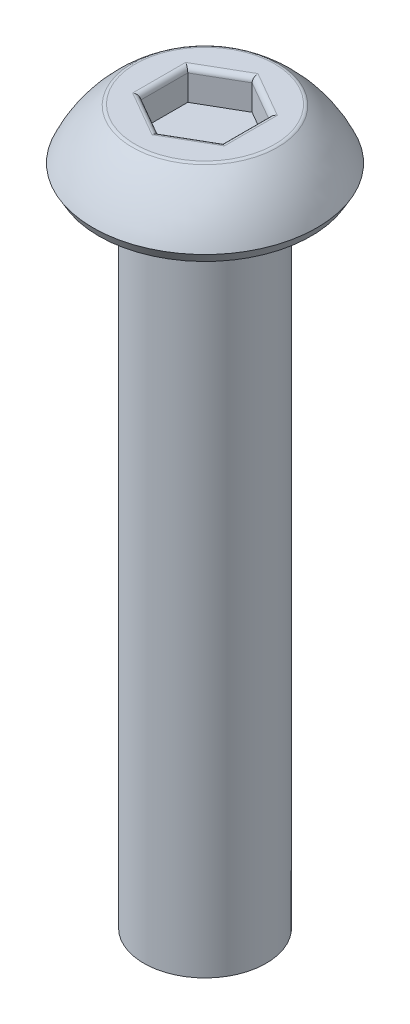
ISO-10303-21;
HEADER;
FILE_DESCRIPTION(('STEP AP214'),'2;1');
FILE_NAME('part.step','',(''),(''),'','','');
FILE_SCHEMA(('AUTOMOTIVE_DESIGN { 1 0 10303 214 1 1 1 1 }'));
ENDSEC;
DATA;
#1=APPLICATION_CONTEXT('core data for automotive mechanical design processes');
#2=APPLICATION_PROTOCOL_DEFINITION('international standard','automotive_design',2000,#1);
#3=PRODUCT_CONTEXT('',#1,'mechanical');
#4=PRODUCT('Part','Part','',(#3));
#5=PRODUCT_RELATED_PRODUCT_CATEGORY('part','',(#4));
#6=PRODUCT_DEFINITION_FORMATION('','',#4);
#7=PRODUCT_DEFINITION_CONTEXT('part definition',#1,'design');
#8=PRODUCT_DEFINITION('design','',#6,#7);
#9=PRODUCT_DEFINITION_SHAPE('','',#8);
#10=(LENGTH_UNIT() NAMED_UNIT(*) SI_UNIT(.MILLI.,.METRE.));
#11=(NAMED_UNIT(*) PLANE_ANGLE_UNIT() SI_UNIT($,.RADIAN.));
#12=(NAMED_UNIT(*) SI_UNIT($,.STERADIAN.) SOLID_ANGLE_UNIT());
#13=UNCERTAINTY_MEASURE_WITH_UNIT(LENGTH_MEASURE(1.E-05),#10,'distance_accuracy_value','');
#14=(GEOMETRIC_REPRESENTATION_CONTEXT(3) GLOBAL_UNCERTAINTY_ASSIGNED_CONTEXT((#13)) GLOBAL_UNIT_ASSIGNED_CONTEXT((#10,
#11,#12)) REPRESENTATION_CONTEXT('',''));
#15=CARTESIAN_POINT('',(0.,0.,0.));
#16=DIRECTION('',(0.,0.,1.));
#17=DIRECTION('',(1.,0.,0.));
#18=AXIS2_PLACEMENT_3D('',#15,#16,#17);
#19=CARTESIAN_POINT('',(0.,1.5,0.));
#20=DIRECTION('',(0.,-1.,0.));
#21=DIRECTION('',(0.,0.,-1.));
#22=AXIS2_PLACEMENT_3D('',#19,#20,#21);
#23=PLANE('',#22);
#24=CARTESIAN_POINT('',(0.,1.5,0.));
#25=DIRECTION('',(0.,-1.,0.));
#26=DIRECTION('',(0.,0.,-1.));
#27=AXIS2_PLACEMENT_3D('',#24,#25,#26);
#28=CIRCLE('',#27,1.70906948191647);
#29=CARTESIAN_POINT('',(0.,1.5,-1.70906948191647));
#30=VERTEX_POINT('',#29);
#31=EDGE_CURVE('E178',#30,#30,#28,.F.);
#32=ORIENTED_EDGE('',*,*,#31,.T.);
#33=EDGE_LOOP('',(#32));
#34=FACE_BOUND('',#33,.T.);
#35=DIRECTION('',(0.866025403784439,0.,-0.5));
#36=VECTOR('',#35,1.);
#37=CARTESIAN_POINT('',(0.5625,1.5,0.974278579257493));
#38=LINE('',#37,#36);
#39=CARTESIAN_POINT('',(1.125,1.5,0.649519052838329));
#40=VERTEX_POINT('',#39);
#41=CARTESIAN_POINT('',(0.,1.5,1.29903810567666));
#42=VERTEX_POINT('',#41);
#43=EDGE_CURVE('E173',#40,#42,#38,.F.);
#44=ORIENTED_EDGE('',*,*,#43,.T.);
#45=DIRECTION('',(0.866025403784439,0.,0.5));
#46=VECTOR('',#45,1.);
#47=CARTESIAN_POINT('',(-0.5625,1.5,0.974278579257493));
#48=LINE('',#47,#46);
#49=CARTESIAN_POINT('',(-1.125,1.5,0.649519052838329));
#50=VERTEX_POINT('',#49);
#51=EDGE_CURVE('E175',#42,#50,#48,.F.);
#52=ORIENTED_EDGE('',*,*,#51,.T.);
#53=DIRECTION('',(0.,0.,1.));
#54=VECTOR('',#53,1.);
#55=CARTESIAN_POINT('',(-1.125,1.5,0.));
#56=LINE('',#55,#54);
#57=CARTESIAN_POINT('',(-1.125,1.5,-0.649519052838329));
#58=VERTEX_POINT('',#57);
#59=EDGE_CURVE('E165',#50,#58,#56,.F.);
#60=ORIENTED_EDGE('',*,*,#59,.T.);
#61=DIRECTION('',(-0.866025403784439,0.,0.5));
#62=VECTOR('',#61,1.);
#63=CARTESIAN_POINT('',(-0.5625,1.5,-0.974278579257493));
#64=LINE('',#63,#62);
#65=CARTESIAN_POINT('',(0.,1.5,-1.29903810567666));
#66=VERTEX_POINT('',#65);
#67=EDGE_CURVE('E167',#58,#66,#64,.F.);
#68=ORIENTED_EDGE('',*,*,#67,.T.);
#69=DIRECTION('',(-0.866025403784439,0.,-0.5));
#70=VECTOR('',#69,1.);
#71=CARTESIAN_POINT('',(0.5625,1.5,-0.974278579257494));
#72=LINE('',#71,#70);
#73=CARTESIAN_POINT('',(1.125,1.5,-0.64951905283833));
#74=VERTEX_POINT('',#73);
#75=EDGE_CURVE('E169',#66,#74,#72,.F.);
#76=ORIENTED_EDGE('',*,*,#75,.T.);
#77=DIRECTION('',(0.,0.,-1.));
#78=VECTOR('',#77,1.);
#79=CARTESIAN_POINT('',(1.125,1.5,0.));
#80=LINE('',#79,#78);
#81=EDGE_CURVE('E171',#74,#40,#80,.F.);
#82=ORIENTED_EDGE('',*,*,#81,.T.);
#83=EDGE_LOOP('',(#44,#52,#60,#68,#76,#82));
#84=FACE_BOUND('',#83,.T.);
#85=ADVANCED_FACE('F36',(#34,#84),#23,.F.);
#86=CARTESIAN_POINT('',(0.,-0.931154789034212,0.));
#87=DIRECTION('',(0.,-1.,0.));
#88=DIRECTION('',(0.,0.,-1.));
#89=AXIS2_PLACEMENT_3D('',#86,#87,#88);
#90=DEGENERATE_TOROIDAL_SURFACE('',#89,0.00769348629276519,3.,.F.);
#91=CARTESIAN_POINT('',(0.,1.47526759952323,0.));
#92=DIRECTION('',(0.,-1.,0.));
#93=DIRECTION('',(0.,0.,-1.));
#94=AXIS2_PLACEMENT_3D('',#91,#92,#93);
#95=CIRCLE('',#94,1.78371135009948);
#96=CARTESIAN_POINT('',(0.,1.47526759952323,-1.78371135009948));
#97=VERTEX_POINT('',#96);
#98=EDGE_CURVE('E162',#97,#97,#95,.T.);
#99=ORIENTED_EDGE('',*,*,#98,.T.);
#100=EDGE_LOOP('',(#99));
#101=FACE_BOUND('',#100,.T.);
#102=CARTESIAN_POINT('',(0.,0.25,0.));
#103=DIRECTION('',(0.,-1.,0.));
#104=DIRECTION('',(0.,0.,-1.));
#105=AXIS2_PLACEMENT_3D('',#102,#103,#104);
#106=CIRCLE('',#105,2.75);
#107=CARTESIAN_POINT('',(0.,0.25,-2.75));
#108=VERTEX_POINT('',#107);
#109=EDGE_CURVE('E159',#108,#108,#106,.T.);
#110=ORIENTED_EDGE('',*,*,#109,.F.);
#111=EDGE_LOOP('',(#110));
#112=FACE_BOUND('',#111,.T.);
#113=ADVANCED_FACE('F245',(#101,#112),#90,.F.);
#114=CARTESIAN_POINT('',(0.,0.25,0.));
#115=DIRECTION('',(0.,1.,0.));
#116=DIRECTION('',(0.,0.,1.));
#117=AXIS2_PLACEMENT_3D('',#114,#115,#116);
#118=CONICAL_SURFACE('',#117,2.75,0.523598775598296);
#119=CARTESIAN_POINT('',(0.,0.,0.));
#120=DIRECTION('',(0.,-1.,0.));
#121=DIRECTION('',(0.,0.,-1.));
#122=AXIS2_PLACEMENT_3D('',#119,#120,#121);
#123=CIRCLE('',#122,2.60566243270259);
#124=CARTESIAN_POINT('',(0.,0.,-2.60566243270259));
#125=VERTEX_POINT('',#124);
#126=EDGE_CURVE('E156',#125,#125,#123,.T.);
#127=ORIENTED_EDGE('',*,*,#126,.F.);
#128=EDGE_LOOP('',(#127));
#129=FACE_BOUND('',#128,.T.);
#130=ORIENTED_EDGE('',*,*,#109,.T.);
#131=EDGE_LOOP('',(#130));
#132=FACE_BOUND('',#131,.T.);
#133=ADVANCED_FACE('F251',(#129,#132),#118,.T.);
#134=CARTESIAN_POINT('',(0.,0.,2.60566243270259));
#135=DIRECTION('',(0.,1.,0.));
#136=DIRECTION('',(0.,0.,1.));
#137=AXIS2_PLACEMENT_3D('',#134,#135,#136);
#138=PLANE('',#137);
#139=CARTESIAN_POINT('',(0.,0.,0.));
#140=DIRECTION('',(0.,-1.,0.));
#141=DIRECTION('',(0.,0.,-1.));
#142=AXIS2_PLACEMENT_3D('',#139,#140,#141);
#143=CIRCLE('',#142,1.5);
#144=CARTESIAN_POINT('',(0.,0.,-1.5));
#145=VERTEX_POINT('',#144);
#146=EDGE_CURVE('E153',#145,#145,#143,.T.);
#147=ORIENTED_EDGE('',*,*,#146,.F.);
#148=EDGE_LOOP('',(#147));
#149=FACE_BOUND('',#148,.T.);
#150=ORIENTED_EDGE('',*,*,#126,.T.);
#151=EDGE_LOOP('',(#150));
#152=FACE_BOUND('',#151,.T.);
#153=ADVANCED_FACE('F270',(#149,#152),#138,.F.);
#154=CARTESIAN_POINT('',(0.,-16.,0.));
#155=DIRECTION('',(0.,-1.,0.));
#156=DIRECTION('',(0.,0.,-1.));
#157=AXIS2_PLACEMENT_3D('',#154,#155,#156);
#158=CYLINDRICAL_SURFACE('',#157,1.5);
#159=CARTESIAN_POINT('',(0.,-16.,0.));
#160=DIRECTION('',(0.,-1.,0.));
#161=DIRECTION('',(0.,0.,-1.));
#162=AXIS2_PLACEMENT_3D('',#159,#160,#161);
#163=CIRCLE('',#162,1.5);
#164=CARTESIAN_POINT('',(0.,-16.,-1.5));
#165=VERTEX_POINT('',#164);
#166=EDGE_CURVE('E140',#165,#165,#163,.T.);
#167=ORIENTED_EDGE('',*,*,#166,.F.);
#168=EDGE_LOOP('',(#167));
#169=FACE_BOUND('',#168,.T.);
#170=ORIENTED_EDGE('',*,*,#146,.T.);
#171=EDGE_LOOP('',(#170));
#172=FACE_BOUND('',#171,.T.);
#173=ADVANCED_FACE('F275',(#169,#172),#158,.T.);
#174=CARTESIAN_POINT('',(0.,-16.,1.5));
#175=DIRECTION('',(0.,1.,0.));
#176=DIRECTION('',(0.,0.,1.));
#177=AXIS2_PLACEMENT_3D('',#174,#175,#176);
#178=PLANE('',#177);
#179=ORIENTED_EDGE('',*,*,#166,.T.);
#180=EDGE_LOOP('',(#179));
#181=FACE_BOUND('',#180,.T.);
#182=ADVANCED_FACE('F282',(#181),#178,.F.);
#183=CARTESIAN_POINT('',(0.999999999999999,0.75,-0.577350269189626));
#184=DIRECTION('',(0.5,0.,-0.866025403784439));
#185=DIRECTION('',(-0.866025403784439,0.,-0.5));
#186=AXIS2_PLACEMENT_3D('',#183,#184,#185);
#187=PLANE('',#186);
#188=DIRECTION('',(0.,1.,0.));
#189=VECTOR('',#188,1.);
#190=CARTESIAN_POINT('',(0.999999999999999,0.75,-0.577350269189626));
#191=LINE('',#190,#189);
#192=CARTESIAN_POINT('',(0.999999999999999,0.75,-0.577350269189626));
#193=VERTEX_POINT('',#192);
#194=CARTESIAN_POINT('',(0.999999999999999,1.375,-0.577350269189626));
#195=VERTEX_POINT('',#194);
#196=EDGE_CURVE('E138',#193,#195,#191,.T.);
#197=ORIENTED_EDGE('',*,*,#196,.T.);
#198=DIRECTION('',(-0.866025403784439,0.,-0.5));
#199=VECTOR('',#198,1.);
#200=CARTESIAN_POINT('',(0.999999999999999,1.375,-0.577350269189626));
#201=LINE('',#200,#199);
#202=CARTESIAN_POINT('',(0.,1.375,-1.15470053837925));
#203=VERTEX_POINT('',#202);
#204=EDGE_CURVE('E60',#195,#203,#201,.T.);
#205=ORIENTED_EDGE('',*,*,#204,.T.);
#206=DIRECTION('',(0.,1.,0.));
#207=VECTOR('',#206,1.);
#208=CARTESIAN_POINT('',(0.,0.75,-1.15470053837925));
#209=LINE('',#208,#207);
#210=CARTESIAN_POINT('',(0.,0.75,-1.15470053837925));
#211=VERTEX_POINT('',#210);
#212=EDGE_CURVE('E106',#211,#203,#209,.T.);
#213=ORIENTED_EDGE('',*,*,#212,.F.);
#214=DIRECTION('',(-0.866025403784439,0.,-0.5));
#215=VECTOR('',#214,1.);
#216=CARTESIAN_POINT('',(0.999999999999999,0.75,-0.577350269189626));
#217=LINE('',#216,#215);
#218=EDGE_CURVE('E110',#193,#211,#217,.T.);
#219=ORIENTED_EDGE('',*,*,#218,.F.);
#220=EDGE_LOOP('',(#197,#205,#213,#219));
#221=FACE_BOUND('',#220,.T.);
#222=ADVANCED_FACE('F108',(#221),#187,.F.);
#223=CARTESIAN_POINT('',(1.,0.75,0.577350269189626));
#224=DIRECTION('',(1.,0.,0.));
#225=DIRECTION('',(0.,0.,-1.));
#226=AXIS2_PLACEMENT_3D('',#223,#224,#225);
#227=PLANE('',#226);
#228=DIRECTION('',(0.,1.,0.));
#229=VECTOR('',#228,1.);
#230=CARTESIAN_POINT('',(1.,0.75,0.577350269189626));
#231=LINE('',#230,#229);
#232=CARTESIAN_POINT('',(1.,0.75,0.577350269189626));
#233=VERTEX_POINT('',#232);
#234=CARTESIAN_POINT('',(1.,1.375,0.577350269189626));
#235=VERTEX_POINT('',#234);
#236=EDGE_CURVE('E141',#233,#235,#231,.T.);
#237=ORIENTED_EDGE('',*,*,#236,.T.);
#238=DIRECTION('',(0.,0.,-1.));
#239=VECTOR('',#238,1.);
#240=CARTESIAN_POINT('',(1.,1.375,0.577350269189626));
#241=LINE('',#240,#239);
#242=EDGE_CURVE('E186',#235,#195,#241,.T.);
#243=ORIENTED_EDGE('',*,*,#242,.T.);
#244=ORIENTED_EDGE('',*,*,#196,.F.);
#245=DIRECTION('',(0.,0.,-1.));
#246=VECTOR('',#245,1.);
#247=CARTESIAN_POINT('',(1.,0.75,0.577350269189626));
#248=LINE('',#247,#246);
#249=EDGE_CURVE('E114',#233,#193,#248,.T.);
#250=ORIENTED_EDGE('',*,*,#249,.F.);
#251=EDGE_LOOP('',(#237,#243,#244,#250));
#252=FACE_BOUND('',#251,.T.);
#253=ADVANCED_FACE('F226',(#252),#227,.F.);
#254=CARTESIAN_POINT('',(0.,0.75,1.15470053837925));
#255=DIRECTION('',(0.5,0.,0.866025403784439));
#256=DIRECTION('',(0.866025403784439,0.,-0.5));
#257=AXIS2_PLACEMENT_3D('',#254,#255,#256);
#258=PLANE('',#257);
#259=DIRECTION('',(0.,1.,0.));
#260=VECTOR('',#259,1.);
#261=CARTESIAN_POINT('',(0.,0.75,1.15470053837925));
#262=LINE('',#261,#260);
#263=CARTESIAN_POINT('',(0.,0.75,1.15470053837925));
#264=VERTEX_POINT('',#263);
#265=CARTESIAN_POINT('',(0.,1.375,1.15470053837925));
#266=VERTEX_POINT('',#265);
#267=EDGE_CURVE('E144',#264,#266,#262,.T.);
#268=ORIENTED_EDGE('',*,*,#267,.T.);
#269=DIRECTION('',(0.866025403784439,0.,-0.5));
#270=VECTOR('',#269,1.);
#271=CARTESIAN_POINT('',(0.,1.375,1.15470053837925));
#272=LINE('',#271,#270);
#273=EDGE_CURVE('E184',#266,#235,#272,.T.);
#274=ORIENTED_EDGE('',*,*,#273,.T.);
#275=ORIENTED_EDGE('',*,*,#236,.F.);
#276=DIRECTION('',(0.866025403784439,0.,-0.5));
#277=VECTOR('',#276,1.);
#278=CARTESIAN_POINT('',(0.,0.75,1.15470053837925));
#279=LINE('',#278,#277);
#280=EDGE_CURVE('E135',#264,#233,#279,.T.);
#281=ORIENTED_EDGE('',*,*,#280,.F.);
#282=EDGE_LOOP('',(#268,#274,#275,#281));
#283=FACE_BOUND('',#282,.T.);
#284=ADVANCED_FACE('F227',(#283),#258,.F.);
#285=CARTESIAN_POINT('',(-0.999999999999999,0.75,0.577350269189626));
#286=DIRECTION('',(-0.5,0.,0.866025403784439));
#287=DIRECTION('',(0.866025403784439,0.,0.5));
#288=AXIS2_PLACEMENT_3D('',#285,#286,#287);
#289=PLANE('',#288);
#290=DIRECTION('',(0.,1.,0.));
#291=VECTOR('',#290,1.);
#292=CARTESIAN_POINT('',(-0.999999999999999,0.75,0.577350269189626));
#293=LINE('',#292,#291);
#294=CARTESIAN_POINT('',(-0.999999999999999,0.75,0.577350269189626));
#295=VERTEX_POINT('',#294);
#296=CARTESIAN_POINT('',(-0.999999999999999,1.375,0.577350269189626));
#297=VERTEX_POINT('',#296);
#298=EDGE_CURVE('E147',#295,#297,#293,.T.);
#299=ORIENTED_EDGE('',*,*,#298,.T.);
#300=DIRECTION('',(0.866025403784439,0.,0.5));
#301=VECTOR('',#300,1.);
#302=CARTESIAN_POINT('',(-0.999999999999999,1.375,0.577350269189626));
#303=LINE('',#302,#301);
#304=EDGE_CURVE('E181',#297,#266,#303,.T.);
#305=ORIENTED_EDGE('',*,*,#304,.T.);
#306=ORIENTED_EDGE('',*,*,#267,.F.);
#307=DIRECTION('',(0.866025403784439,0.,0.5));
#308=VECTOR('',#307,1.);
#309=CARTESIAN_POINT('',(-0.999999999999999,0.75,0.577350269189626));
#310=LINE('',#309,#308);
#311=EDGE_CURVE('E132',#295,#264,#310,.T.);
#312=ORIENTED_EDGE('',*,*,#311,.F.);
#313=EDGE_LOOP('',(#299,#305,#306,#312));
#314=FACE_BOUND('',#313,.T.);
#315=ADVANCED_FACE('F222',(#314),#289,.F.);
#316=CARTESIAN_POINT('',(-1.,0.75,-0.577350269189626));
#317=DIRECTION('',(-1.,0.,0.));
#318=DIRECTION('',(0.,0.,1.));
#319=AXIS2_PLACEMENT_3D('',#316,#317,#318);
#320=PLANE('',#319);
#321=DIRECTION('',(0.,1.,0.));
#322=VECTOR('',#321,1.);
#323=CARTESIAN_POINT('',(-1.,0.75,-0.577350269189626));
#324=LINE('',#323,#322);
#325=CARTESIAN_POINT('',(-1.,0.75,-0.577350269189626));
#326=VERTEX_POINT('',#325);
#327=CARTESIAN_POINT('',(-1.,1.375,-0.577350269189626));
#328=VERTEX_POINT('',#327);
#329=EDGE_CURVE('E113',#326,#328,#324,.T.);
#330=ORIENTED_EDGE('',*,*,#329,.T.);
#331=DIRECTION('',(0.,0.,1.));
#332=VECTOR('',#331,1.);
#333=CARTESIAN_POINT('',(-1.,1.375,-0.577350269189626));
#334=LINE('',#333,#332);
#335=EDGE_CURVE('E11',#328,#297,#334,.T.);
#336=ORIENTED_EDGE('',*,*,#335,.T.);
#337=ORIENTED_EDGE('',*,*,#298,.F.);
#338=DIRECTION('',(0.,0.,1.));
#339=VECTOR('',#338,1.);
#340=CARTESIAN_POINT('',(-1.,0.75,-0.577350269189626));
#341=LINE('',#340,#339);
#342=EDGE_CURVE('E122',#326,#295,#341,.T.);
#343=ORIENTED_EDGE('',*,*,#342,.F.);
#344=EDGE_LOOP('',(#330,#336,#337,#343));
#345=FACE_BOUND('',#344,.T.);
#346=ADVANCED_FACE('F219',(#345),#320,.F.);
#347=CARTESIAN_POINT('',(0.,0.75,-1.15470053837925));
#348=DIRECTION('',(-0.5,0.,-0.866025403784438));
#349=DIRECTION('',(-0.866025403784439,0.,0.5));
#350=AXIS2_PLACEMENT_3D('',#347,#348,#349);
#351=PLANE('',#350);
#352=ORIENTED_EDGE('',*,*,#212,.T.);
#353=DIRECTION('',(-0.866025403784439,0.,0.5));
#354=VECTOR('',#353,1.);
#355=CARTESIAN_POINT('',(0.,1.375,-1.15470053837925));
#356=LINE('',#355,#354);
#357=EDGE_CURVE('E45',#203,#328,#356,.T.);
#358=ORIENTED_EDGE('',*,*,#357,.T.);
#359=ORIENTED_EDGE('',*,*,#329,.F.);
#360=DIRECTION('',(-0.866025403784439,0.,0.5));
#361=VECTOR('',#360,1.);
#362=CARTESIAN_POINT('',(0.,0.75,-1.15470053837925));
#363=LINE('',#362,#361);
#364=EDGE_CURVE('E117',#211,#326,#363,.T.);
#365=ORIENTED_EDGE('',*,*,#364,.F.);
#366=EDGE_LOOP('',(#352,#358,#359,#365));
#367=FACE_BOUND('',#366,.T.);
#368=ADVANCED_FACE('F118',(#367),#351,.F.);
#369=CARTESIAN_POINT('',(0.,0.75,0.));
#370=DIRECTION('',(0.,1.,0.));
#371=DIRECTION('',(0.,0.,1.));
#372=AXIS2_PLACEMENT_3D('',#369,#370,#371);
#373=PLANE('',#372);
#374=ORIENTED_EDGE('',*,*,#218,.T.);
#375=ORIENTED_EDGE('',*,*,#364,.T.);
#376=ORIENTED_EDGE('',*,*,#342,.T.);
#377=ORIENTED_EDGE('',*,*,#311,.T.);
#378=ORIENTED_EDGE('',*,*,#280,.T.);
#379=ORIENTED_EDGE('',*,*,#249,.T.);
#380=EDGE_LOOP('',(#374,#375,#376,#377,#378,#379));
#381=FACE_BOUND('',#380,.T.);
#382=ADVANCED_FACE('F124',(#381),#373,.T.);
#383=CARTESIAN_POINT('',(0.,1.375,0.));
#384=DIRECTION('',(0.,-1.,0.));
#385=DIRECTION('',(0.,0.,-1.));
#386=AXIS2_PLACEMENT_3D('',#383,#384,#385);
#387=TOROIDAL_SURFACE('',#386,1.70906948191647,0.125);
#388=ORIENTED_EDGE('',*,*,#31,.F.);
#389=EDGE_LOOP('',(#388));
#390=FACE_BOUND('',#389,.T.);
#391=ORIENTED_EDGE('',*,*,#98,.F.);
#392=EDGE_LOOP('',(#391));
#393=FACE_BOUND('',#392,.T.);
#394=ADVANCED_FACE('F255',(#390,#393),#387,.T.);
#395=CARTESIAN_POINT('',(1.0625,1.375,-0.685603444662681));
#396=DIRECTION('',(-0.866025403784439,0.,-0.5));
#397=DIRECTION('',(-0.5,0.,0.866025403784439));
#398=AXIS2_PLACEMENT_3D('',#395,#396,#397);
#399=CYLINDRICAL_SURFACE('',#398,0.125);
#400=CARTESIAN_POINT('',(1.125,1.375,-0.64951905283833));
#401=DIRECTION('',(-0.5,0.,-0.866025403784438));
#402=DIRECTION('',(0.866025403784439,0.,-0.5));
#403=AXIS2_PLACEMENT_3D('',#400,#401,#402);
#404=ELLIPSE('',#403,0.144337567297406,0.125);
#405=EDGE_CURVE('E129',#74,#195,#404,.F.);
#406=ORIENTED_EDGE('',*,*,#405,.F.);
#407=ORIENTED_EDGE('',*,*,#75,.F.);
#408=CARTESIAN_POINT('',(0.,1.375,-1.29903810567666));
#409=DIRECTION('',(-1.,0.,0.));
#410=DIRECTION('',(0.,0.,-1.));
#411=AXIS2_PLACEMENT_3D('',#408,#409,#410);
#412=ELLIPSE('',#411,0.144337567297406,0.125);
#413=EDGE_CURVE('E40',#203,#66,#412,.T.);
#414=ORIENTED_EDGE('',*,*,#413,.F.);
#415=ORIENTED_EDGE('',*,*,#204,.F.);
#416=EDGE_LOOP('',(#406,#407,#414,#415));
#417=FACE_BOUND('',#416,.T.);
#418=ADVANCED_FACE('F38',(#417),#399,.T.);
#419=CARTESIAN_POINT('',(-0.0625000000000002,1.375,-1.26295371385231));
#420=DIRECTION('',(-0.866025403784439,0.,0.5));
#421=DIRECTION('',(0.5,0.,0.866025403784439));
#422=AXIS2_PLACEMENT_3D('',#419,#420,#421);
#423=CYLINDRICAL_SURFACE('',#422,0.125);
#424=ORIENTED_EDGE('',*,*,#413,.T.);
#425=ORIENTED_EDGE('',*,*,#67,.F.);
#426=CARTESIAN_POINT('',(-1.125,1.375,-0.649519052838329));
#427=DIRECTION('',(-0.5,0.,0.866025403784439));
#428=DIRECTION('',(-0.866025403784439,0.,-0.5));
#429=AXIS2_PLACEMENT_3D('',#426,#427,#428);
#430=ELLIPSE('',#429,0.144337567297406,0.125);
#431=EDGE_CURVE('E197',#328,#58,#430,.T.);
#432=ORIENTED_EDGE('',*,*,#431,.F.);
#433=ORIENTED_EDGE('',*,*,#357,.F.);
#434=EDGE_LOOP('',(#424,#425,#432,#433));
#435=FACE_BOUND('',#434,.T.);
#436=ADVANCED_FACE('F211',(#435),#423,.T.);
#437=CARTESIAN_POINT('',(1.125,1.375,0.577350269189626));
#438=DIRECTION('',(0.,0.,-1.));
#439=DIRECTION('',(-1.,0.,0.));
#440=AXIS2_PLACEMENT_3D('',#437,#438,#439);
#441=CYLINDRICAL_SURFACE('',#440,0.125);
#442=ORIENTED_EDGE('',*,*,#405,.T.);
#443=ORIENTED_EDGE('',*,*,#242,.F.);
#444=CARTESIAN_POINT('',(1.125,1.375,0.649519052838329));
#445=DIRECTION('',(0.5,0.,-0.866025403784439));
#446=DIRECTION('',(0.866025403784439,0.,0.5));
#447=AXIS2_PLACEMENT_3D('',#444,#445,#446);
#448=ELLIPSE('',#447,0.144337567297406,0.125);
#449=EDGE_CURVE('E194',#40,#235,#448,.F.);
#450=ORIENTED_EDGE('',*,*,#449,.F.);
#451=ORIENTED_EDGE('',*,*,#81,.F.);
#452=EDGE_LOOP('',(#442,#443,#450,#451));
#453=FACE_BOUND('',#452,.T.);
#454=ADVANCED_FACE('F204',(#453),#441,.T.);
#455=CARTESIAN_POINT('',(-1.125,1.375,-0.577350269189626));
#456=DIRECTION('',(0.,0.,1.));
#457=DIRECTION('',(1.,0.,0.));
#458=AXIS2_PLACEMENT_3D('',#455,#456,#457);
#459=CYLINDRICAL_SURFACE('',#458,0.125);
#460=ORIENTED_EDGE('',*,*,#431,.T.);
#461=ORIENTED_EDGE('',*,*,#59,.F.);
#462=CARTESIAN_POINT('',(-1.125,1.375,0.649519052838329));
#463=DIRECTION('',(0.5,0.,0.866025403784438));
#464=DIRECTION('',(0.866025403784439,0.,-0.5));
#465=AXIS2_PLACEMENT_3D('',#462,#463,#464);
#466=ELLIPSE('',#465,0.144337567297406,0.125);
#467=EDGE_CURVE('E192',#297,#50,#466,.T.);
#468=ORIENTED_EDGE('',*,*,#467,.F.);
#469=ORIENTED_EDGE('',*,*,#335,.F.);
#470=EDGE_LOOP('',(#460,#461,#468,#469));
#471=FACE_BOUND('',#470,.T.);
#472=ADVANCED_FACE('F216',(#471),#459,.T.);
#473=CARTESIAN_POINT('',(0.0625000000000004,1.375,1.26295371385231));
#474=DIRECTION('',(0.866025403784439,0.,-0.5));
#475=DIRECTION('',(-0.5,0.,-0.866025403784439));
#476=AXIS2_PLACEMENT_3D('',#473,#474,#475);
#477=CYLINDRICAL_SURFACE('',#476,0.125);
#478=ORIENTED_EDGE('',*,*,#449,.T.);
#479=ORIENTED_EDGE('',*,*,#273,.F.);
#480=CARTESIAN_POINT('',(0.,1.375,1.29903810567666));
#481=DIRECTION('',(1.,0.,0.));
#482=DIRECTION('',(0.,0.,1.));
#483=AXIS2_PLACEMENT_3D('',#480,#481,#482);
#484=ELLIPSE('',#483,0.144337567297406,0.125);
#485=EDGE_CURVE('E190',#42,#266,#484,.F.);
#486=ORIENTED_EDGE('',*,*,#485,.F.);
#487=ORIENTED_EDGE('',*,*,#43,.F.);
#488=EDGE_LOOP('',(#478,#479,#486,#487));
#489=FACE_BOUND('',#488,.T.);
#490=ADVANCED_FACE('F231',(#489),#477,.T.);
#491=CARTESIAN_POINT('',(-1.0625,1.375,0.685603444662681));
#492=DIRECTION('',(0.866025403784439,0.,0.5));
#493=DIRECTION('',(0.5,0.,-0.866025403784439));
#494=AXIS2_PLACEMENT_3D('',#491,#492,#493);
#495=CYLINDRICAL_SURFACE('',#494,0.125);
#496=ORIENTED_EDGE('',*,*,#467,.T.);
#497=ORIENTED_EDGE('',*,*,#51,.F.);
#498=ORIENTED_EDGE('',*,*,#485,.T.);
#499=ORIENTED_EDGE('',*,*,#304,.F.);
#500=EDGE_LOOP('',(#496,#497,#498,#499));
#501=FACE_BOUND('',#500,.T.);
#502=ADVANCED_FACE('F236',(#501),#495,.T.);
#503=CLOSED_SHELL('',(#85,#113,#133,#153,#173,#182,#222,#253,#284,#315,#346,#368,#382,#394,#418,
#436,#454,#472,#490,#502));
#504=MANIFOLD_SOLID_BREP('B2',#503);
#505=ADVANCED_BREP_SHAPE_REPRESENTATION('',(#18,#504),#14);
#506=SHAPE_DEFINITION_REPRESENTATION(#9,#505);
ENDSEC;
END-ISO-10303-21;
